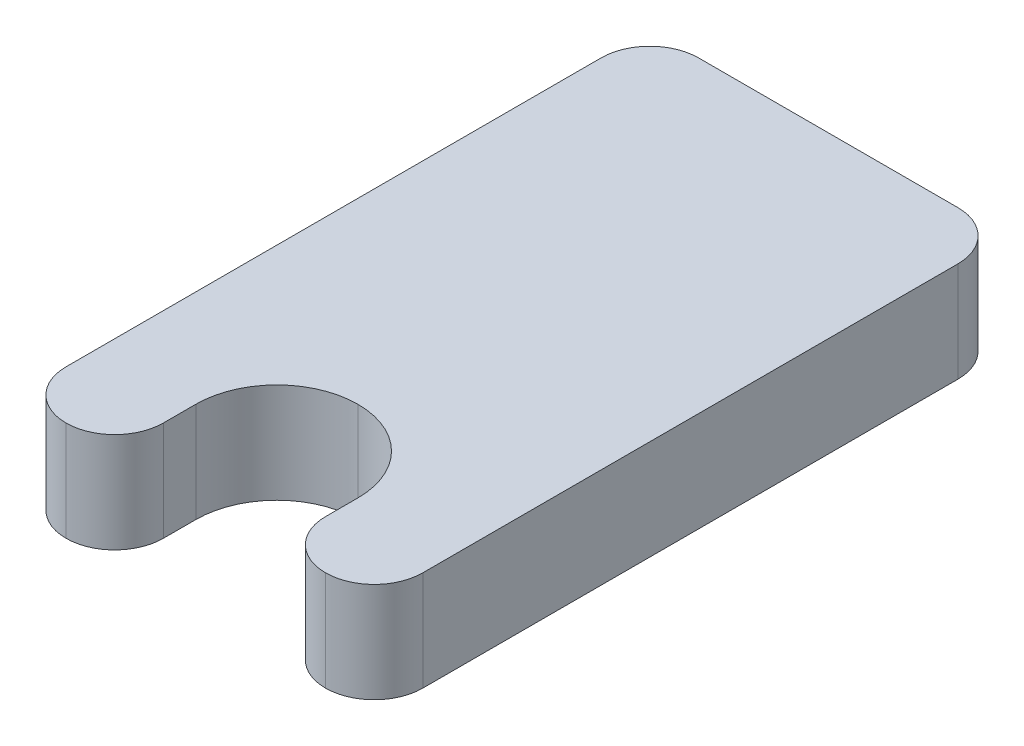
ISO-10303-21;
HEADER;
FILE_DESCRIPTION(('STEP AP214'),'2;1');
FILE_NAME('part.step','',(''),(''),'','','');
FILE_SCHEMA(('AUTOMOTIVE_DESIGN { 1 0 10303 214 1 1 1 1 }'));
ENDSEC;
DATA;
#1=APPLICATION_CONTEXT('core data for automotive mechanical design processes');
#2=APPLICATION_PROTOCOL_DEFINITION('international standard','automotive_design',2000,#1);
#3=PRODUCT_CONTEXT('',#1,'mechanical');
#4=PRODUCT('Part','Part','',(#3));
#5=PRODUCT_RELATED_PRODUCT_CATEGORY('part','',(#4));
#6=PRODUCT_DEFINITION_FORMATION('','',#4);
#7=PRODUCT_DEFINITION_CONTEXT('part definition',#1,'design');
#8=PRODUCT_DEFINITION('design','',#6,#7);
#9=PRODUCT_DEFINITION_SHAPE('','',#8);
#10=(LENGTH_UNIT() NAMED_UNIT(*) SI_UNIT(.MILLI.,.METRE.));
#11=(NAMED_UNIT(*) PLANE_ANGLE_UNIT() SI_UNIT($,.RADIAN.));
#12=(NAMED_UNIT(*) SI_UNIT($,.STERADIAN.) SOLID_ANGLE_UNIT());
#13=UNCERTAINTY_MEASURE_WITH_UNIT(LENGTH_MEASURE(1.E-05),#10,'distance_accuracy_value','');
#14=(GEOMETRIC_REPRESENTATION_CONTEXT(3) GLOBAL_UNCERTAINTY_ASSIGNED_CONTEXT((#13)) GLOBAL_UNIT_ASSIGNED_CONTEXT((#10,
#11,#12)) REPRESENTATION_CONTEXT('',''));
#15=CARTESIAN_POINT('',(0.,0.,0.));
#16=DIRECTION('',(0.,0.,1.));
#17=DIRECTION('',(1.,0.,0.));
#18=AXIS2_PLACEMENT_3D('',#15,#16,#17);
#19=CARTESIAN_POINT('',(2.5,3.08,-2.5));
#20=DIRECTION('',(1.,0.,0.));
#21=DIRECTION('',(0.,0.,-1.));
#22=AXIS2_PLACEMENT_3D('',#19,#20,#21);
#23=PLANE('',#22);
#24=DIRECTION('',(0.,0.,1.));
#25=VECTOR('',#24,1.);
#26=CARTESIAN_POINT('',(2.5,0.,-2.5));
#27=LINE('',#26,#25);
#28=CARTESIAN_POINT('',(2.5,0.,0.));
#29=VERTEX_POINT('',#28);
#30=CARTESIAN_POINT('',(2.5,0.,0.999999999999999));
#31=VERTEX_POINT('',#30);
#32=EDGE_CURVE('E177',#29,#31,#27,.T.);
#33=ORIENTED_EDGE('',*,*,#32,.T.);
#34=DIRECTION('',(0.,-1.,0.));
#35=VECTOR('',#34,1.);
#36=CARTESIAN_POINT('',(2.5,3.08,0.999999999999999));
#37=LINE('',#36,#35);
#38=CARTESIAN_POINT('',(2.5,3.08,0.999999999999999));
#39=VERTEX_POINT('',#38);
#40=EDGE_CURVE('E52',#31,#39,#37,.F.);
#41=ORIENTED_EDGE('',*,*,#40,.T.);
#42=DIRECTION('',(0.,0.,1.));
#43=VECTOR('',#42,1.);
#44=CARTESIAN_POINT('',(2.5,3.08,-2.5));
#45=LINE('',#44,#43);
#46=CARTESIAN_POINT('',(2.5,3.08,0.));
#47=VERTEX_POINT('',#46);
#48=EDGE_CURVE('E145',#47,#39,#45,.T.);
#49=ORIENTED_EDGE('',*,*,#48,.F.);
#50=DIRECTION('',(0.,-1.,0.));
#51=VECTOR('',#50,1.);
#52=CARTESIAN_POINT('',(2.5,0.,0.));
#53=LINE('',#52,#51);
#54=EDGE_CURVE('E159',#47,#29,#53,.T.);
#55=ORIENTED_EDGE('',*,*,#54,.T.);
#56=EDGE_LOOP('',(#33,#41,#49,#55));
#57=FACE_BOUND('',#56,.T.);
#58=ADVANCED_FACE('F43',(#57),#23,.F.);
#59=CARTESIAN_POINT('',(5.5,3.08,2.5));
#60=DIRECTION('',(-1.,0.,0.));
#61=DIRECTION('',(0.,0.,1.));
#62=AXIS2_PLACEMENT_3D('',#59,#60,#61);
#63=PLANE('',#62);
#64=DIRECTION('',(0.,0.,-1.));
#65=VECTOR('',#64,1.);
#66=CARTESIAN_POINT('',(5.5,0.,2.5));
#67=LINE('',#66,#65);
#68=CARTESIAN_POINT('',(5.5,0.,0.999999999999999));
#69=VERTEX_POINT('',#68);
#70=CARTESIAN_POINT('',(5.5,0.,-15.5));
#71=VERTEX_POINT('',#70);
#72=EDGE_CURVE('E234',#69,#71,#67,.T.);
#73=ORIENTED_EDGE('',*,*,#72,.T.);
#74=DIRECTION('',(0.,-1.,0.));
#75=VECTOR('',#74,1.);
#76=CARTESIAN_POINT('',(5.5,3.08,-15.5));
#77=LINE('',#76,#75);
#78=CARTESIAN_POINT('',(5.5,3.08,-15.5));
#79=VERTEX_POINT('',#78);
#80=EDGE_CURVE('E214',#71,#79,#77,.F.);
#81=ORIENTED_EDGE('',*,*,#80,.T.);
#82=DIRECTION('',(0.,0.,-1.));
#83=VECTOR('',#82,1.);
#84=CARTESIAN_POINT('',(5.5,3.08,2.5));
#85=LINE('',#84,#83);
#86=CARTESIAN_POINT('',(5.5,3.08,0.999999999999999));
#87=VERTEX_POINT('',#86);
#88=EDGE_CURVE('E245',#87,#79,#85,.T.);
#89=ORIENTED_EDGE('',*,*,#88,.F.);
#90=DIRECTION('',(0.,-1.,0.));
#91=VECTOR('',#90,1.);
#92=CARTESIAN_POINT('',(5.5,3.08,0.999999999999999));
#93=LINE('',#92,#91);
#94=EDGE_CURVE('E211',#87,#69,#93,.T.);
#95=ORIENTED_EDGE('',*,*,#94,.T.);
#96=EDGE_LOOP('',(#73,#81,#89,#95));
#97=FACE_BOUND('',#96,.T.);
#98=ADVANCED_FACE('F264',(#97),#63,.F.);
#99=CARTESIAN_POINT('',(-5.5,3.08,-17.));
#100=DIRECTION('',(0.,0.,1.));
#101=DIRECTION('',(1.,0.,0.));
#102=AXIS2_PLACEMENT_3D('',#99,#100,#101);
#103=PLANE('',#102);
#104=DIRECTION('',(-1.,0.,0.));
#105=VECTOR('',#104,1.);
#106=CARTESIAN_POINT('',(-5.5,0.,-17.));
#107=LINE('',#106,#105);
#108=CARTESIAN_POINT('',(4.,0.,-17.));
#109=VERTEX_POINT('',#108);
#110=CARTESIAN_POINT('',(-4.,0.,-17.));
#111=VERTEX_POINT('',#110);
#112=EDGE_CURVE('E232',#109,#111,#107,.T.);
#113=ORIENTED_EDGE('',*,*,#112,.T.);
#114=DIRECTION('',(0.,-1.,0.));
#115=VECTOR('',#114,1.);
#116=CARTESIAN_POINT('',(-4.,3.08,-17.));
#117=LINE('',#116,#115);
#118=CARTESIAN_POINT('',(-4.,3.08,-17.));
#119=VERTEX_POINT('',#118);
#120=EDGE_CURVE('E199',#111,#119,#117,.F.);
#121=ORIENTED_EDGE('',*,*,#120,.T.);
#122=DIRECTION('',(-1.,0.,0.));
#123=VECTOR('',#122,1.);
#124=CARTESIAN_POINT('',(-5.5,3.08,-17.));
#125=LINE('',#124,#123);
#126=CARTESIAN_POINT('',(4.,3.08,-17.));
#127=VERTEX_POINT('',#126);
#128=EDGE_CURVE('E242',#127,#119,#125,.T.);
#129=ORIENTED_EDGE('',*,*,#128,.F.);
#130=DIRECTION('',(0.,-1.,0.));
#131=VECTOR('',#130,1.);
#132=CARTESIAN_POINT('',(4.,3.08,-17.));
#133=LINE('',#132,#131);
#134=EDGE_CURVE('E196',#127,#109,#133,.T.);
#135=ORIENTED_EDGE('',*,*,#134,.T.);
#136=EDGE_LOOP('',(#113,#121,#129,#135));
#137=FACE_BOUND('',#136,.T.);
#138=ADVANCED_FACE('F273',(#137),#103,.F.);
#139=CARTESIAN_POINT('',(-5.5,3.08,2.5));
#140=DIRECTION('',(1.,0.,0.));
#141=DIRECTION('',(0.,0.,-1.));
#142=AXIS2_PLACEMENT_3D('',#139,#140,#141);
#143=PLANE('',#142);
#144=DIRECTION('',(0.,0.,1.));
#145=VECTOR('',#144,1.);
#146=CARTESIAN_POINT('',(-5.5,3.08,2.5));
#147=LINE('',#146,#145);
#148=CARTESIAN_POINT('',(-5.5,3.08,-15.5));
#149=VERTEX_POINT('',#148);
#150=CARTESIAN_POINT('',(-5.5,3.08,0.999999999999999));
#151=VERTEX_POINT('',#150);
#152=EDGE_CURVE('E166',#149,#151,#147,.T.);
#153=ORIENTED_EDGE('',*,*,#152,.F.);
#154=DIRECTION('',(0.,-1.,0.));
#155=VECTOR('',#154,1.);
#156=CARTESIAN_POINT('',(-5.5,3.08,-15.5));
#157=LINE('',#156,#155);
#158=CARTESIAN_POINT('',(-5.5,0.,-15.5));
#159=VERTEX_POINT('',#158);
#160=EDGE_CURVE('E181',#149,#159,#157,.T.);
#161=ORIENTED_EDGE('',*,*,#160,.T.);
#162=DIRECTION('',(0.,0.,1.));
#163=VECTOR('',#162,1.);
#164=CARTESIAN_POINT('',(-5.5,0.,2.5));
#165=LINE('',#164,#163);
#166=CARTESIAN_POINT('',(-5.5,0.,0.999999999999999));
#167=VERTEX_POINT('',#166);
#168=EDGE_CURVE('E146',#159,#167,#165,.T.);
#169=ORIENTED_EDGE('',*,*,#168,.T.);
#170=DIRECTION('',(0.,-1.,0.));
#171=VECTOR('',#170,1.);
#172=CARTESIAN_POINT('',(-5.5,3.08,0.999999999999999));
#173=LINE('',#172,#171);
#174=EDGE_CURVE('E174',#167,#151,#173,.F.);
#175=ORIENTED_EDGE('',*,*,#174,.T.);
#176=EDGE_LOOP('',(#153,#161,#169,#175));
#177=FACE_BOUND('',#176,.T.);
#178=ADVANCED_FACE('F230',(#177),#143,.F.);
#179=CARTESIAN_POINT('',(-2.5,3.08,-2.5));
#180=DIRECTION('',(-1.,0.,0.));
#181=DIRECTION('',(0.,0.,1.));
#182=AXIS2_PLACEMENT_3D('',#179,#180,#181);
#183=PLANE('',#182);
#184=DIRECTION('',(0.,0.,-1.));
#185=VECTOR('',#184,1.);
#186=CARTESIAN_POINT('',(-2.5,3.08,-2.5));
#187=LINE('',#186,#185);
#188=CARTESIAN_POINT('',(-2.5,3.08,0.999999999999999));
#189=VERTEX_POINT('',#188);
#190=CARTESIAN_POINT('',(-2.5,3.08,0.));
#191=VERTEX_POINT('',#190);
#192=EDGE_CURVE('E163',#189,#191,#187,.T.);
#193=ORIENTED_EDGE('',*,*,#192,.F.);
#194=DIRECTION('',(0.,-1.,0.));
#195=VECTOR('',#194,1.);
#196=CARTESIAN_POINT('',(-2.5,3.08,0.999999999999999));
#197=LINE('',#196,#195);
#198=CARTESIAN_POINT('',(-2.5,0.,0.999999999999999));
#199=VERTEX_POINT('',#198);
#200=EDGE_CURVE('E13',#189,#199,#197,.T.);
#201=ORIENTED_EDGE('',*,*,#200,.T.);
#202=DIRECTION('',(0.,0.,-1.));
#203=VECTOR('',#202,1.);
#204=CARTESIAN_POINT('',(-2.5,0.,-2.5));
#205=LINE('',#204,#203);
#206=CARTESIAN_POINT('',(-2.5,0.,0.));
#207=VERTEX_POINT('',#206);
#208=EDGE_CURVE('E137',#199,#207,#205,.T.);
#209=ORIENTED_EDGE('',*,*,#208,.T.);
#210=DIRECTION('',(0.,-1.,0.));
#211=VECTOR('',#210,1.);
#212=CARTESIAN_POINT('',(-2.5,3.08,0.));
#213=LINE('',#212,#211);
#214=EDGE_CURVE('E141',#207,#191,#213,.F.);
#215=ORIENTED_EDGE('',*,*,#214,.T.);
#216=EDGE_LOOP('',(#193,#201,#209,#215));
#217=FACE_BOUND('',#216,.T.);
#218=ADVANCED_FACE('F139',(#217),#183,.F.);
#219=CARTESIAN_POINT('',(0.,3.08,0.));
#220=DIRECTION('',(0.,1.,0.));
#221=DIRECTION('',(0.,0.,1.));
#222=AXIS2_PLACEMENT_3D('',#219,#220,#221);
#223=PLANE('',#222);
#224=ORIENTED_EDGE('',*,*,#128,.T.);
#225=CARTESIAN_POINT('',(-4.,3.08,-15.5));
#226=DIRECTION('',(0.,1.,0.));
#227=DIRECTION('',(0.,0.,1.));
#228=AXIS2_PLACEMENT_3D('',#225,#226,#227);
#229=CIRCLE('',#228,1.5);
#230=EDGE_CURVE('E209',#119,#149,#229,.T.);
#231=ORIENTED_EDGE('',*,*,#230,.T.);
#232=ORIENTED_EDGE('',*,*,#152,.T.);
#233=CARTESIAN_POINT('',(-4.,3.08,0.999999999999999));
#234=DIRECTION('',(0.,1.,0.));
#235=DIRECTION('',(0.,0.,1.));
#236=AXIS2_PLACEMENT_3D('',#233,#234,#235);
#237=CIRCLE('',#236,1.5);
#238=CARTESIAN_POINT('',(-4.,3.08,2.5));
#239=VERTEX_POINT('',#238);
#240=EDGE_CURVE('E65',#151,#239,#237,.T.);
#241=ORIENTED_EDGE('',*,*,#240,.T.);
#242=CARTESIAN_POINT('',(-4.,3.08,0.999999999999999));
#243=DIRECTION('',(0.,1.,0.));
#244=DIRECTION('',(0.,0.,1.));
#245=AXIS2_PLACEMENT_3D('',#242,#243,#244);
#246=CIRCLE('',#245,1.5);
#247=EDGE_CURVE('E60',#239,#189,#246,.T.);
#248=ORIENTED_EDGE('',*,*,#247,.T.);
#249=ORIENTED_EDGE('',*,*,#192,.T.);
#250=CARTESIAN_POINT('',(0.,3.08,0.));
#251=DIRECTION('',(0.,1.,0.));
#252=DIRECTION('',(0.,0.,1.));
#253=AXIS2_PLACEMENT_3D('',#250,#251,#252);
#254=CIRCLE('',#253,2.5);
#255=CARTESIAN_POINT('',(0.,3.08,-2.5));
#256=VERTEX_POINT('',#255);
#257=EDGE_CURVE('E158',#191,#256,#254,.F.);
#258=ORIENTED_EDGE('',*,*,#257,.T.);
#259=CARTESIAN_POINT('',(0.,3.08,0.));
#260=DIRECTION('',(0.,1.,0.));
#261=DIRECTION('',(0.,0.,1.));
#262=AXIS2_PLACEMENT_3D('',#259,#260,#261);
#263=CIRCLE('',#262,2.5);
#264=EDGE_CURVE('E172',#256,#47,#263,.F.);
#265=ORIENTED_EDGE('',*,*,#264,.T.);
#266=ORIENTED_EDGE('',*,*,#48,.T.);
#267=CARTESIAN_POINT('',(4.,3.08,0.999999999999999));
#268=DIRECTION('',(0.,1.,0.));
#269=DIRECTION('',(0.,0.,1.));
#270=AXIS2_PLACEMENT_3D('',#267,#268,#269);
#271=CIRCLE('',#270,1.5);
#272=CARTESIAN_POINT('',(4.,3.08,2.5));
#273=VERTEX_POINT('',#272);
#274=EDGE_CURVE('E203',#39,#273,#271,.T.);
#275=ORIENTED_EDGE('',*,*,#274,.T.);
#276=CARTESIAN_POINT('',(4.,3.08,0.999999999999999));
#277=DIRECTION('',(0.,1.,0.));
#278=DIRECTION('',(0.,0.,1.));
#279=AXIS2_PLACEMENT_3D('',#276,#277,#278);
#280=CIRCLE('',#279,1.5);
#281=EDGE_CURVE('E205',#273,#87,#280,.T.);
#282=ORIENTED_EDGE('',*,*,#281,.T.);
#283=ORIENTED_EDGE('',*,*,#88,.T.);
#284=CARTESIAN_POINT('',(4.,3.08,-15.5));
#285=DIRECTION('',(0.,1.,0.));
#286=DIRECTION('',(0.,0.,1.));
#287=AXIS2_PLACEMENT_3D('',#284,#285,#286);
#288=CIRCLE('',#287,1.5);
#289=EDGE_CURVE('E207',#79,#127,#288,.T.);
#290=ORIENTED_EDGE('',*,*,#289,.T.);
#291=EDGE_LOOP('',(#224,#231,#232,#241,#248,#249,#258,#265,#266,#275,#282,#283,#290));
#292=FACE_BOUND('',#291,.T.);
#293=ADVANCED_FACE('F251',(#292),#223,.T.);
#294=CARTESIAN_POINT('',(0.,0.,0.));
#295=DIRECTION('',(0.,1.,0.));
#296=DIRECTION('',(0.,0.,1.));
#297=AXIS2_PLACEMENT_3D('',#294,#295,#296);
#298=PLANE('',#297);
#299=ORIENTED_EDGE('',*,*,#168,.F.);
#300=CARTESIAN_POINT('',(-4.,0.,-15.5));
#301=DIRECTION('',(0.,1.,0.));
#302=DIRECTION('',(0.,0.,1.));
#303=AXIS2_PLACEMENT_3D('',#300,#301,#302);
#304=CIRCLE('',#303,1.5);
#305=EDGE_CURVE('E194',#159,#111,#304,.F.);
#306=ORIENTED_EDGE('',*,*,#305,.T.);
#307=ORIENTED_EDGE('',*,*,#112,.F.);
#308=CARTESIAN_POINT('',(4.,0.,-15.5));
#309=DIRECTION('',(0.,1.,0.));
#310=DIRECTION('',(0.,0.,1.));
#311=AXIS2_PLACEMENT_3D('',#308,#309,#310);
#312=CIRCLE('',#311,1.5);
#313=EDGE_CURVE('E192',#109,#71,#312,.F.);
#314=ORIENTED_EDGE('',*,*,#313,.T.);
#315=ORIENTED_EDGE('',*,*,#72,.F.);
#316=CARTESIAN_POINT('',(4.,0.,0.999999999999999));
#317=DIRECTION('',(0.,1.,0.));
#318=DIRECTION('',(0.,0.,1.));
#319=AXIS2_PLACEMENT_3D('',#316,#317,#318);
#320=CIRCLE('',#319,1.5);
#321=CARTESIAN_POINT('',(4.,0.,2.5));
#322=VERTEX_POINT('',#321);
#323=EDGE_CURVE('E190',#69,#322,#320,.F.);
#324=ORIENTED_EDGE('',*,*,#323,.T.);
#325=CARTESIAN_POINT('',(4.,0.,0.999999999999999));
#326=DIRECTION('',(0.,1.,0.));
#327=DIRECTION('',(0.,0.,1.));
#328=AXIS2_PLACEMENT_3D('',#325,#326,#327);
#329=CIRCLE('',#328,1.5);
#330=EDGE_CURVE('E188',#322,#31,#329,.F.);
#331=ORIENTED_EDGE('',*,*,#330,.T.);
#332=ORIENTED_EDGE('',*,*,#32,.F.);
#333=CARTESIAN_POINT('',(0.,0.,0.));
#334=DIRECTION('',(0.,1.,0.));
#335=DIRECTION('',(0.,0.,1.));
#336=AXIS2_PLACEMENT_3D('',#333,#334,#335);
#337=CIRCLE('',#336,2.5);
#338=CARTESIAN_POINT('',(0.,0.,-2.5));
#339=VERTEX_POINT('',#338);
#340=EDGE_CURVE('E154',#29,#339,#337,.T.);
#341=ORIENTED_EDGE('',*,*,#340,.T.);
#342=CARTESIAN_POINT('',(0.,0.,0.));
#343=DIRECTION('',(0.,1.,0.));
#344=DIRECTION('',(0.,0.,1.));
#345=AXIS2_PLACEMENT_3D('',#342,#343,#344);
#346=CIRCLE('',#345,2.5);
#347=EDGE_CURVE('E149',#339,#207,#346,.T.);
#348=ORIENTED_EDGE('',*,*,#347,.T.);
#349=ORIENTED_EDGE('',*,*,#208,.F.);
#350=CARTESIAN_POINT('',(-4.,0.,0.999999999999999));
#351=DIRECTION('',(0.,1.,0.));
#352=DIRECTION('',(0.,0.,1.));
#353=AXIS2_PLACEMENT_3D('',#350,#351,#352);
#354=CIRCLE('',#353,1.5);
#355=CARTESIAN_POINT('',(-4.,0.,2.5));
#356=VERTEX_POINT('',#355);
#357=EDGE_CURVE('E184',#199,#356,#354,.F.);
#358=ORIENTED_EDGE('',*,*,#357,.T.);
#359=CARTESIAN_POINT('',(-4.,0.,0.999999999999999));
#360=DIRECTION('',(0.,1.,0.));
#361=DIRECTION('',(0.,0.,1.));
#362=AXIS2_PLACEMENT_3D('',#359,#360,#361);
#363=CIRCLE('',#362,1.5);
#364=EDGE_CURVE('E186',#356,#167,#363,.F.);
#365=ORIENTED_EDGE('',*,*,#364,.T.);
#366=EDGE_LOOP('',(#299,#306,#307,#314,#315,#324,#331,#332,#341,#348,#349,#358,#365));
#367=FACE_BOUND('',#366,.T.);
#368=ADVANCED_FACE('F151',(#367),#298,.F.);
#369=CARTESIAN_POINT('',(0.,3.08,0.));
#370=DIRECTION('',(0.,1.,0.));
#371=DIRECTION('',(0.,0.,1.));
#372=AXIS2_PLACEMENT_3D('',#369,#370,#371);
#373=CYLINDRICAL_SURFACE('',#372,2.5);
#374=ORIENTED_EDGE('',*,*,#54,.F.);
#375=ORIENTED_EDGE('',*,*,#264,.F.);
#376=DIRECTION('',(0.,-1.,0.));
#377=VECTOR('',#376,1.);
#378=CARTESIAN_POINT('',(0.,3.08,-2.5));
#379=LINE('',#378,#377);
#380=EDGE_CURVE('E175',#339,#256,#379,.F.);
#381=ORIENTED_EDGE('',*,*,#380,.F.);
#382=ORIENTED_EDGE('',*,*,#340,.F.);
#383=EDGE_LOOP('',(#374,#375,#381,#382));
#384=FACE_BOUND('',#383,.T.);
#385=ADVANCED_FACE('F279',(#384),#373,.F.);
#386=CARTESIAN_POINT('',(0.,3.08,0.));
#387=DIRECTION('',(0.,1.,0.));
#388=DIRECTION('',(0.,0.,1.));
#389=AXIS2_PLACEMENT_3D('',#386,#387,#388);
#390=CYLINDRICAL_SURFACE('',#389,2.5);
#391=ORIENTED_EDGE('',*,*,#257,.F.);
#392=ORIENTED_EDGE('',*,*,#214,.F.);
#393=ORIENTED_EDGE('',*,*,#347,.F.);
#394=ORIENTED_EDGE('',*,*,#380,.T.);
#395=EDGE_LOOP('',(#391,#392,#393,#394));
#396=FACE_BOUND('',#395,.T.);
#397=ADVANCED_FACE('F162',(#396),#390,.F.);
#398=CARTESIAN_POINT('',(-4.,3.08,-15.5));
#399=DIRECTION('',(0.,-1.,0.));
#400=DIRECTION('',(0.,0.,-1.));
#401=AXIS2_PLACEMENT_3D('',#398,#399,#400);
#402=CYLINDRICAL_SURFACE('',#401,1.5);
#403=ORIENTED_EDGE('',*,*,#230,.F.);
#404=ORIENTED_EDGE('',*,*,#120,.F.);
#405=ORIENTED_EDGE('',*,*,#305,.F.);
#406=ORIENTED_EDGE('',*,*,#160,.F.);
#407=EDGE_LOOP('',(#403,#404,#405,#406));
#408=FACE_BOUND('',#407,.T.);
#409=ADVANCED_FACE('F277',(#408),#402,.T.);
#410=CARTESIAN_POINT('',(4.,3.08,-15.5));
#411=DIRECTION('',(0.,-1.,0.));
#412=DIRECTION('',(0.,0.,-1.));
#413=AXIS2_PLACEMENT_3D('',#410,#411,#412);
#414=CYLINDRICAL_SURFACE('',#413,1.5);
#415=ORIENTED_EDGE('',*,*,#289,.F.);
#416=ORIENTED_EDGE('',*,*,#80,.F.);
#417=ORIENTED_EDGE('',*,*,#313,.F.);
#418=ORIENTED_EDGE('',*,*,#134,.F.);
#419=EDGE_LOOP('',(#415,#416,#417,#418));
#420=FACE_BOUND('',#419,.T.);
#421=ADVANCED_FACE('F268',(#420),#414,.T.);
#422=CARTESIAN_POINT('',(4.,3.08,0.999999999999999));
#423=DIRECTION('',(0.,-1.,0.));
#424=DIRECTION('',(0.,0.,-1.));
#425=AXIS2_PLACEMENT_3D('',#422,#423,#424);
#426=CYLINDRICAL_SURFACE('',#425,1.5);
#427=DIRECTION('',(0.,-1.,0.));
#428=VECTOR('',#427,1.);
#429=CARTESIAN_POINT('',(4.,3.08,2.5));
#430=LINE('',#429,#428);
#431=EDGE_CURVE('E178',#273,#322,#430,.T.);
#432=ORIENTED_EDGE('',*,*,#431,.F.);
#433=ORIENTED_EDGE('',*,*,#274,.F.);
#434=ORIENTED_EDGE('',*,*,#40,.F.);
#435=ORIENTED_EDGE('',*,*,#330,.F.);
#436=EDGE_LOOP('',(#432,#433,#434,#435));
#437=FACE_BOUND('',#436,.T.);
#438=ADVANCED_FACE('F257',(#437),#426,.T.);
#439=CARTESIAN_POINT('',(4.,3.08,0.999999999999999));
#440=DIRECTION('',(0.,-1.,0.));
#441=DIRECTION('',(0.,0.,-1.));
#442=AXIS2_PLACEMENT_3D('',#439,#440,#441);
#443=CYLINDRICAL_SURFACE('',#442,1.5);
#444=ORIENTED_EDGE('',*,*,#281,.F.);
#445=ORIENTED_EDGE('',*,*,#431,.T.);
#446=ORIENTED_EDGE('',*,*,#323,.F.);
#447=ORIENTED_EDGE('',*,*,#94,.F.);
#448=EDGE_LOOP('',(#444,#445,#446,#447));
#449=FACE_BOUND('',#448,.T.);
#450=ADVANCED_FACE('F260',(#449),#443,.T.);
#451=CARTESIAN_POINT('',(-4.,3.08,0.999999999999999));
#452=DIRECTION('',(0.,-1.,0.));
#453=DIRECTION('',(0.,0.,-1.));
#454=AXIS2_PLACEMENT_3D('',#451,#452,#453);
#455=CYLINDRICAL_SURFACE('',#454,1.5);
#456=ORIENTED_EDGE('',*,*,#200,.F.);
#457=ORIENTED_EDGE('',*,*,#247,.F.);
#458=DIRECTION('',(0.,-1.,0.));
#459=VECTOR('',#458,1.);
#460=CARTESIAN_POINT('',(-4.,3.08,2.5));
#461=LINE('',#460,#459);
#462=EDGE_CURVE('E47',#356,#239,#461,.F.);
#463=ORIENTED_EDGE('',*,*,#462,.F.);
#464=ORIENTED_EDGE('',*,*,#357,.F.);
#465=EDGE_LOOP('',(#456,#457,#463,#464));
#466=FACE_BOUND('',#465,.T.);
#467=ADVANCED_FACE('F45',(#466),#455,.T.);
#468=CARTESIAN_POINT('',(-4.,3.08,0.999999999999999));
#469=DIRECTION('',(0.,-1.,0.));
#470=DIRECTION('',(0.,0.,-1.));
#471=AXIS2_PLACEMENT_3D('',#468,#469,#470);
#472=CYLINDRICAL_SURFACE('',#471,1.5);
#473=ORIENTED_EDGE('',*,*,#240,.F.);
#474=ORIENTED_EDGE('',*,*,#174,.F.);
#475=ORIENTED_EDGE('',*,*,#364,.F.);
#476=ORIENTED_EDGE('',*,*,#462,.T.);
#477=EDGE_LOOP('',(#473,#474,#475,#476));
#478=FACE_BOUND('',#477,.T.);
#479=ADVANCED_FACE('F224',(#478),#472,.T.);
#480=CLOSED_SHELL('',(#58,#98,#138,#178,#218,#293,#368,#385,#397,#409,#421,#438,#450,#467,#479));
#481=MANIFOLD_SOLID_BREP('B2',#480);
#482=ADVANCED_BREP_SHAPE_REPRESENTATION('',(#18,#481),#14);
#483=SHAPE_DEFINITION_REPRESENTATION(#9,#482);
ENDSEC;
END-ISO-10303-21;
